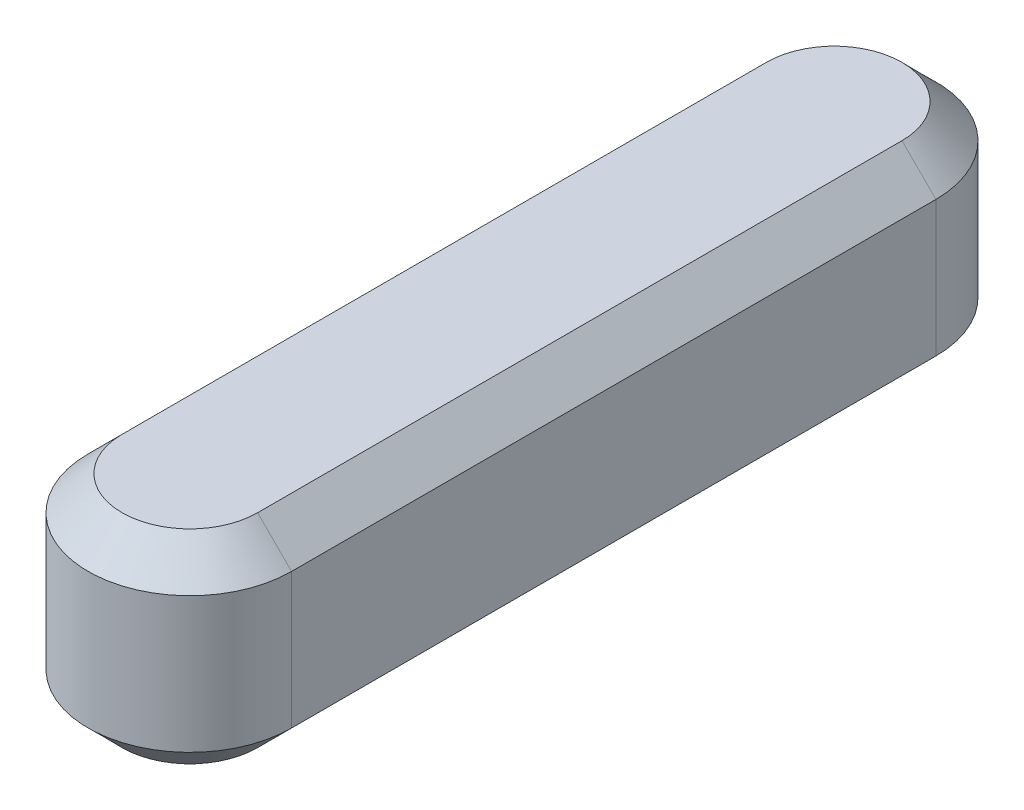
ISO-10303-21;
HEADER;
FILE_DESCRIPTION(('STEP AP214'),'2;1');
FILE_NAME('part.step','',(''),(''),'','','');
FILE_SCHEMA(('AUTOMOTIVE_DESIGN { 1 0 10303 214 1 1 1 1 }'));
ENDSEC;
DATA;
#1=APPLICATION_CONTEXT('core data for automotive mechanical design processes');
#2=APPLICATION_PROTOCOL_DEFINITION('international standard','automotive_design',2000,#1);
#3=PRODUCT_CONTEXT('',#1,'mechanical');
#4=PRODUCT('Part','Part','',(#3));
#5=PRODUCT_RELATED_PRODUCT_CATEGORY('part','',(#4));
#6=PRODUCT_DEFINITION_FORMATION('','',#4);
#7=PRODUCT_DEFINITION_CONTEXT('part definition',#1,'design');
#8=PRODUCT_DEFINITION('design','',#6,#7);
#9=PRODUCT_DEFINITION_SHAPE('','',#8);
#10=(LENGTH_UNIT() NAMED_UNIT(*) SI_UNIT(.MILLI.,.METRE.));
#11=(NAMED_UNIT(*) PLANE_ANGLE_UNIT() SI_UNIT($,.RADIAN.));
#12=(NAMED_UNIT(*) SI_UNIT($,.STERADIAN.) SOLID_ANGLE_UNIT());
#13=UNCERTAINTY_MEASURE_WITH_UNIT(LENGTH_MEASURE(1.E-05),#10,'distance_accuracy_value','');
#14=(GEOMETRIC_REPRESENTATION_CONTEXT(3) GLOBAL_UNCERTAINTY_ASSIGNED_CONTEXT((#13)) GLOBAL_UNIT_ASSIGNED_CONTEXT((#10,
#11,#12)) REPRESENTATION_CONTEXT('',''));
#15=CARTESIAN_POINT('',(0.,0.,0.));
#16=DIRECTION('',(0.,0.,1.));
#17=DIRECTION('',(1.,0.,0.));
#18=AXIS2_PLACEMENT_3D('',#15,#16,#17);
#19=CARTESIAN_POINT('',(0.,6.,0.));
#20=DIRECTION('',(0.,-1.,0.));
#21=DIRECTION('',(0.,0.,-1.));
#22=AXIS2_PLACEMENT_3D('',#19,#20,#21);
#23=CYLINDRICAL_SURFACE('',#22,3.);
#24=DIRECTION('',(0.,-1.,0.));
#25=VECTOR('',#24,1.);
#26=CARTESIAN_POINT('',(3.,6.,0.));
#27=LINE('',#26,#25);
#28=CARTESIAN_POINT('',(3.,5.,0.));
#29=VERTEX_POINT('',#28);
#30=CARTESIAN_POINT('',(3.,1.,0.));
#31=VERTEX_POINT('',#30);
#32=EDGE_CURVE('E136',#29,#31,#27,.T.);
#33=ORIENTED_EDGE('',*,*,#32,.F.);
#34=CARTESIAN_POINT('',(0.,5.,0.));
#35=DIRECTION('',(0.,-1.,0.));
#36=DIRECTION('',(0.,0.,-1.));
#37=AXIS2_PLACEMENT_3D('',#34,#35,#36);
#38=CIRCLE('',#37,3.);
#39=CARTESIAN_POINT('',(-3.,5.,0.));
#40=VERTEX_POINT('',#39);
#41=EDGE_CURVE('E185',#29,#40,#38,.T.);
#42=ORIENTED_EDGE('',*,*,#41,.T.);
#43=DIRECTION('',(0.,-1.,0.));
#44=VECTOR('',#43,1.);
#45=CARTESIAN_POINT('',(-3.,6.,0.));
#46=LINE('',#45,#44);
#47=CARTESIAN_POINT('',(-3.,1.,0.));
#48=VERTEX_POINT('',#47);
#49=EDGE_CURVE('E145',#40,#48,#46,.T.);
#50=ORIENTED_EDGE('',*,*,#49,.T.);
#51=CARTESIAN_POINT('',(0.,1.,0.));
#52=DIRECTION('',(0.,-1.,0.));
#53=DIRECTION('',(0.,0.,-1.));
#54=AXIS2_PLACEMENT_3D('',#51,#52,#53);
#55=CIRCLE('',#54,3.);
#56=EDGE_CURVE('E188',#48,#31,#55,.F.);
#57=ORIENTED_EDGE('',*,*,#56,.T.);
#58=EDGE_LOOP('',(#33,#42,#50,#57));
#59=FACE_BOUND('',#58,.T.);
#60=ADVANCED_FACE('F44',(#59),#23,.T.);
#61=CARTESIAN_POINT('',(3.,6.,0.));
#62=DIRECTION('',(-1.,0.,0.));
#63=DIRECTION('',(0.,0.,1.));
#64=AXIS2_PLACEMENT_3D('',#61,#62,#63);
#65=PLANE('',#64);
#66=DIRECTION('',(0.,-1.,0.));
#67=VECTOR('',#66,1.);
#68=CARTESIAN_POINT('',(3.,6.,-19.));
#69=LINE('',#68,#67);
#70=CARTESIAN_POINT('',(3.,5.,-19.));
#71=VERTEX_POINT('',#70);
#72=CARTESIAN_POINT('',(3.,1.,-19.));
#73=VERTEX_POINT('',#72);
#74=EDGE_CURVE('E210',#71,#73,#69,.T.);
#75=ORIENTED_EDGE('',*,*,#74,.F.);
#76=DIRECTION('',(0.,0.,1.));
#77=VECTOR('',#76,1.);
#78=CARTESIAN_POINT('',(3.,5.,0.));
#79=LINE('',#78,#77);
#80=EDGE_CURVE('E196',#71,#29,#79,.T.);
#81=ORIENTED_EDGE('',*,*,#80,.T.);
#82=ORIENTED_EDGE('',*,*,#32,.T.);
#83=DIRECTION('',(0.,0.,-1.));
#84=VECTOR('',#83,1.);
#85=CARTESIAN_POINT('',(3.,1.,-19.));
#86=LINE('',#85,#84);
#87=EDGE_CURVE('E200',#31,#73,#86,.T.);
#88=ORIENTED_EDGE('',*,*,#87,.T.);
#89=EDGE_LOOP('',(#75,#81,#82,#88));
#90=FACE_BOUND('',#89,.T.);
#91=ADVANCED_FACE('F243',(#90),#65,.F.);
#92=CARTESIAN_POINT('',(0.,6.,-19.));
#93=DIRECTION('',(0.,-1.,0.));
#94=DIRECTION('',(0.,0.,-1.));
#95=AXIS2_PLACEMENT_3D('',#92,#93,#94);
#96=CYLINDRICAL_SURFACE('',#95,3.);
#97=DIRECTION('',(0.,-1.,0.));
#98=VECTOR('',#97,1.);
#99=CARTESIAN_POINT('',(-3.,6.,-19.));
#100=LINE('',#99,#98);
#101=CARTESIAN_POINT('',(-3.,5.,-19.));
#102=VERTEX_POINT('',#101);
#103=CARTESIAN_POINT('',(-3.,1.,-19.));
#104=VERTEX_POINT('',#103);
#105=EDGE_CURVE('E214',#102,#104,#100,.T.);
#106=ORIENTED_EDGE('',*,*,#105,.F.);
#107=CARTESIAN_POINT('',(0.,5.,-19.));
#108=DIRECTION('',(0.,-1.,0.));
#109=DIRECTION('',(0.,0.,-1.));
#110=AXIS2_PLACEMENT_3D('',#107,#108,#109);
#111=CIRCLE('',#110,3.);
#112=EDGE_CURVE('E139',#102,#71,#111,.T.);
#113=ORIENTED_EDGE('',*,*,#112,.T.);
#114=ORIENTED_EDGE('',*,*,#74,.T.);
#115=CARTESIAN_POINT('',(0.,1.,-19.));
#116=DIRECTION('',(0.,-1.,0.));
#117=DIRECTION('',(0.,0.,-1.));
#118=AXIS2_PLACEMENT_3D('',#115,#116,#117);
#119=CIRCLE('',#118,3.);
#120=EDGE_CURVE('E193',#73,#104,#119,.F.);
#121=ORIENTED_EDGE('',*,*,#120,.T.);
#122=EDGE_LOOP('',(#106,#113,#114,#121));
#123=FACE_BOUND('',#122,.T.);
#124=ADVANCED_FACE('F247',(#123),#96,.T.);
#125=CARTESIAN_POINT('',(-3.,6.,0.));
#126=DIRECTION('',(1.,0.,0.));
#127=DIRECTION('',(0.,0.,-1.));
#128=AXIS2_PLACEMENT_3D('',#125,#126,#127);
#129=PLANE('',#128);
#130=ORIENTED_EDGE('',*,*,#49,.F.);
#131=DIRECTION('',(0.,0.,-1.));
#132=VECTOR('',#131,1.);
#133=CARTESIAN_POINT('',(-3.,5.,0.));
#134=LINE('',#133,#132);
#135=EDGE_CURVE('E178',#40,#102,#134,.T.);
#136=ORIENTED_EDGE('',*,*,#135,.T.);
#137=ORIENTED_EDGE('',*,*,#105,.T.);
#138=DIRECTION('',(0.,0.,1.));
#139=VECTOR('',#138,1.);
#140=CARTESIAN_POINT('',(-3.,1.,0.));
#141=LINE('',#140,#139);
#142=EDGE_CURVE('E181',#104,#48,#141,.T.);
#143=ORIENTED_EDGE('',*,*,#142,.T.);
#144=EDGE_LOOP('',(#130,#136,#137,#143));
#145=FACE_BOUND('',#144,.T.);
#146=ADVANCED_FACE('F225',(#145),#129,.F.);
#147=CARTESIAN_POINT('',(0.,6.,0.));
#148=DIRECTION('',(0.,-1.,0.));
#149=DIRECTION('',(0.,0.,-1.));
#150=AXIS2_PLACEMENT_3D('',#147,#148,#149);
#151=PLANE('',#150);
#152=CARTESIAN_POINT('',(0.,6.,0.));
#153=DIRECTION('',(0.,-1.,0.));
#154=DIRECTION('',(0.,0.,-1.));
#155=AXIS2_PLACEMENT_3D('',#152,#153,#154);
#156=CIRCLE('',#155,2.);
#157=CARTESIAN_POINT('',(-2.,6.,0.));
#158=VERTEX_POINT('',#157);
#159=CARTESIAN_POINT('',(2.,6.,0.));
#160=VERTEX_POINT('',#159);
#161=EDGE_CURVE('E124',#158,#160,#156,.F.);
#162=ORIENTED_EDGE('',*,*,#161,.T.);
#163=DIRECTION('',(0.,0.,-1.));
#164=VECTOR('',#163,1.);
#165=CARTESIAN_POINT('',(2.,6.,0.));
#166=LINE('',#165,#164);
#167=CARTESIAN_POINT('',(2.,6.,-19.));
#168=VERTEX_POINT('',#167);
#169=EDGE_CURVE('E119',#160,#168,#166,.T.);
#170=ORIENTED_EDGE('',*,*,#169,.T.);
#171=CARTESIAN_POINT('',(0.,6.,-19.));
#172=DIRECTION('',(0.,-1.,0.));
#173=DIRECTION('',(0.,0.,-1.));
#174=AXIS2_PLACEMENT_3D('',#171,#172,#173);
#175=CIRCLE('',#174,2.);
#176=CARTESIAN_POINT('',(-2.,6.,-19.));
#177=VERTEX_POINT('',#176);
#178=EDGE_CURVE('E113',#168,#177,#175,.F.);
#179=ORIENTED_EDGE('',*,*,#178,.T.);
#180=DIRECTION('',(0.,0.,1.));
#181=VECTOR('',#180,1.);
#182=CARTESIAN_POINT('',(-2.,6.,0.));
#183=LINE('',#182,#181);
#184=EDGE_CURVE('E116',#177,#158,#183,.T.);
#185=ORIENTED_EDGE('',*,*,#184,.T.);
#186=EDGE_LOOP('',(#162,#170,#179,#185));
#187=FACE_BOUND('',#186,.T.);
#188=ADVANCED_FACE('F115',(#187),#151,.F.);
#189=CARTESIAN_POINT('',(0.,0.,0.));
#190=DIRECTION('',(0.,-1.,0.));
#191=DIRECTION('',(0.,0.,-1.));
#192=AXIS2_PLACEMENT_3D('',#189,#190,#191);
#193=PLANE('',#192);
#194=CARTESIAN_POINT('',(0.,0.,0.));
#195=DIRECTION('',(0.,-1.,0.));
#196=DIRECTION('',(0.,0.,-1.));
#197=AXIS2_PLACEMENT_3D('',#194,#195,#196);
#198=CIRCLE('',#197,2.);
#199=CARTESIAN_POINT('',(2.,0.,0.));
#200=VERTEX_POINT('',#199);
#201=CARTESIAN_POINT('',(-2.,0.,0.));
#202=VERTEX_POINT('',#201);
#203=EDGE_CURVE('E55',#200,#202,#198,.T.);
#204=ORIENTED_EDGE('',*,*,#203,.T.);
#205=DIRECTION('',(0.,0.,-1.));
#206=VECTOR('',#205,1.);
#207=CARTESIAN_POINT('',(-2.,0.,-19.));
#208=LINE('',#207,#206);
#209=CARTESIAN_POINT('',(-2.,0.,-19.));
#210=VERTEX_POINT('',#209);
#211=EDGE_CURVE('E11',#202,#210,#208,.T.);
#212=ORIENTED_EDGE('',*,*,#211,.T.);
#213=CARTESIAN_POINT('',(0.,0.,-19.));
#214=DIRECTION('',(0.,-1.,0.));
#215=DIRECTION('',(0.,0.,-1.));
#216=AXIS2_PLACEMENT_3D('',#213,#214,#215);
#217=CIRCLE('',#216,2.);
#218=CARTESIAN_POINT('',(2.,0.,-19.));
#219=VERTEX_POINT('',#218);
#220=EDGE_CURVE('E172',#210,#219,#217,.T.);
#221=ORIENTED_EDGE('',*,*,#220,.T.);
#222=DIRECTION('',(0.,0.,1.));
#223=VECTOR('',#222,1.);
#224=CARTESIAN_POINT('',(2.,0.,0.));
#225=LINE('',#224,#223);
#226=EDGE_CURVE('E175',#219,#200,#225,.T.);
#227=ORIENTED_EDGE('',*,*,#226,.T.);
#228=EDGE_LOOP('',(#204,#212,#221,#227));
#229=FACE_BOUND('',#228,.T.);
#230=ADVANCED_FACE('F256',(#229),#193,.T.);
#231=CARTESIAN_POINT('',(-2.,6.,0.));
#232=DIRECTION('',(0.707106781186549,-0.707106781186546,0.));
#233=DIRECTION('',(0.,0.,1.));
#234=AXIS2_PLACEMENT_3D('',#231,#232,#233);
#235=PLANE('',#234);
#236=DIRECTION('',(0.707106781186546,0.707106781186549,0.));
#237=VECTOR('',#236,1.);
#238=CARTESIAN_POINT('',(-3.,5.,-19.));
#239=LINE('',#238,#237);
#240=EDGE_CURVE('E130',#102,#177,#239,.T.);
#241=ORIENTED_EDGE('',*,*,#240,.F.);
#242=ORIENTED_EDGE('',*,*,#135,.F.);
#243=DIRECTION('',(-0.707106781186546,-0.707106781186549,0.));
#244=VECTOR('',#243,1.);
#245=CARTESIAN_POINT('',(-2.,6.,0.));
#246=LINE('',#245,#244);
#247=EDGE_CURVE('E133',#158,#40,#246,.T.);
#248=ORIENTED_EDGE('',*,*,#247,.F.);
#249=ORIENTED_EDGE('',*,*,#184,.F.);
#250=EDGE_LOOP('',(#241,#242,#248,#249));
#251=FACE_BOUND('',#250,.T.);
#252=ADVANCED_FACE('F128',(#251),#235,.F.);
#253=CARTESIAN_POINT('',(0.,6.,0.));
#254=DIRECTION('',(0.,-1.,0.));
#255=DIRECTION('',(0.,0.,-1.));
#256=AXIS2_PLACEMENT_3D('',#253,#254,#255);
#257=CONICAL_SURFACE('',#256,2.,0.785398163397447);
#258=ORIENTED_EDGE('',*,*,#247,.T.);
#259=ORIENTED_EDGE('',*,*,#41,.F.);
#260=DIRECTION('',(0.707106781186546,-0.707106781186549,0.));
#261=VECTOR('',#260,1.);
#262=CARTESIAN_POINT('',(2.,6.,0.));
#263=LINE('',#262,#261);
#264=EDGE_CURVE('E141',#160,#29,#263,.T.);
#265=ORIENTED_EDGE('',*,*,#264,.F.);
#266=ORIENTED_EDGE('',*,*,#161,.F.);
#267=EDGE_LOOP('',(#258,#259,#265,#266));
#268=FACE_BOUND('',#267,.T.);
#269=ADVANCED_FACE('F228',(#268),#257,.T.);
#270=CARTESIAN_POINT('',(0.,6.,-19.));
#271=DIRECTION('',(0.,-1.,0.));
#272=DIRECTION('',(0.,0.,-1.));
#273=AXIS2_PLACEMENT_3D('',#270,#271,#272);
#274=CONICAL_SURFACE('',#273,2.,0.785398163397447);
#275=ORIENTED_EDGE('',*,*,#240,.T.);
#276=ORIENTED_EDGE('',*,*,#178,.F.);
#277=DIRECTION('',(-0.707106781186546,0.707106781186549,0.));
#278=VECTOR('',#277,1.);
#279=CARTESIAN_POINT('',(3.,5.,-19.));
#280=LINE('',#279,#278);
#281=EDGE_CURVE('E147',#71,#168,#280,.T.);
#282=ORIENTED_EDGE('',*,*,#281,.F.);
#283=ORIENTED_EDGE('',*,*,#112,.F.);
#284=EDGE_LOOP('',(#275,#276,#282,#283));
#285=FACE_BOUND('',#284,.T.);
#286=ADVANCED_FACE('F138',(#285),#274,.T.);
#287=CARTESIAN_POINT('',(2.,6.,0.));
#288=DIRECTION('',(-0.707106781186549,-0.707106781186546,0.));
#289=DIRECTION('',(0.,0.,-1.));
#290=AXIS2_PLACEMENT_3D('',#287,#288,#289);
#291=PLANE('',#290);
#292=ORIENTED_EDGE('',*,*,#264,.T.);
#293=ORIENTED_EDGE('',*,*,#80,.F.);
#294=ORIENTED_EDGE('',*,*,#281,.T.);
#295=ORIENTED_EDGE('',*,*,#169,.F.);
#296=EDGE_LOOP('',(#292,#293,#294,#295));
#297=FACE_BOUND('',#296,.T.);
#298=ADVANCED_FACE('F230',(#297),#291,.F.);
#299=CARTESIAN_POINT('',(3.,1.,0.));
#300=DIRECTION('',(0.707106781186547,-0.707106781186547,0.));
#301=DIRECTION('',(0.,0.,1.));
#302=AXIS2_PLACEMENT_3D('',#299,#300,#301);
#303=PLANE('',#302);
#304=DIRECTION('',(0.707106781186547,0.707106781186547,0.));
#305=VECTOR('',#304,1.);
#306=CARTESIAN_POINT('',(2.,0.,0.));
#307=LINE('',#306,#305);
#308=EDGE_CURVE('E155',#200,#31,#307,.T.);
#309=ORIENTED_EDGE('',*,*,#308,.F.);
#310=ORIENTED_EDGE('',*,*,#226,.F.);
#311=DIRECTION('',(-0.707106781186547,-0.707106781186547,0.));
#312=VECTOR('',#311,1.);
#313=CARTESIAN_POINT('',(3.,1.,-19.));
#314=LINE('',#313,#312);
#315=EDGE_CURVE('E49',#73,#219,#314,.T.);
#316=ORIENTED_EDGE('',*,*,#315,.F.);
#317=ORIENTED_EDGE('',*,*,#87,.F.);
#318=EDGE_LOOP('',(#309,#310,#316,#317));
#319=FACE_BOUND('',#318,.T.);
#320=ADVANCED_FACE('F47',(#319),#303,.T.);
#321=CARTESIAN_POINT('',(0.,1.,-19.));
#322=DIRECTION('',(0.,1.,0.));
#323=DIRECTION('',(0.,0.,1.));
#324=AXIS2_PLACEMENT_3D('',#321,#322,#323);
#325=CONICAL_SURFACE('',#324,3.,0.785398163397448);
#326=ORIENTED_EDGE('',*,*,#315,.T.);
#327=ORIENTED_EDGE('',*,*,#220,.F.);
#328=DIRECTION('',(0.707106781186547,-0.707106781186547,0.));
#329=VECTOR('',#328,1.);
#330=CARTESIAN_POINT('',(-3.,1.,-19.));
#331=LINE('',#330,#329);
#332=EDGE_CURVE('E68',#104,#210,#331,.T.);
#333=ORIENTED_EDGE('',*,*,#332,.F.);
#334=ORIENTED_EDGE('',*,*,#120,.F.);
#335=EDGE_LOOP('',(#326,#327,#333,#334));
#336=FACE_BOUND('',#335,.T.);
#337=ADVANCED_FACE('F237',(#336),#325,.T.);
#338=CARTESIAN_POINT('',(0.,1.,0.));
#339=DIRECTION('',(0.,1.,0.));
#340=DIRECTION('',(0.,0.,1.));
#341=AXIS2_PLACEMENT_3D('',#338,#339,#340);
#342=CONICAL_SURFACE('',#341,3.,0.785398163397448);
#343=ORIENTED_EDGE('',*,*,#308,.T.);
#344=ORIENTED_EDGE('',*,*,#56,.F.);
#345=DIRECTION('',(-0.707106781186547,0.707106781186547,0.));
#346=VECTOR('',#345,1.);
#347=CARTESIAN_POINT('',(-2.,0.,0.));
#348=LINE('',#347,#346);
#349=EDGE_CURVE('E151',#202,#48,#348,.T.);
#350=ORIENTED_EDGE('',*,*,#349,.F.);
#351=ORIENTED_EDGE('',*,*,#203,.F.);
#352=EDGE_LOOP('',(#343,#344,#350,#351));
#353=FACE_BOUND('',#352,.T.);
#354=ADVANCED_FACE('F306',(#353),#342,.T.);
#355=CARTESIAN_POINT('',(-3.,1.,0.));
#356=DIRECTION('',(-0.707106781186547,-0.707106781186547,0.));
#357=DIRECTION('',(0.,0.,-1.));
#358=AXIS2_PLACEMENT_3D('',#355,#356,#357);
#359=PLANE('',#358);
#360=ORIENTED_EDGE('',*,*,#332,.T.);
#361=ORIENTED_EDGE('',*,*,#211,.F.);
#362=ORIENTED_EDGE('',*,*,#349,.T.);
#363=ORIENTED_EDGE('',*,*,#142,.F.);
#364=EDGE_LOOP('',(#360,#361,#362,#363));
#365=FACE_BOUND('',#364,.T.);
#366=ADVANCED_FACE('F315',(#365),#359,.T.);
#367=CLOSED_SHELL('',(#60,#91,#124,#146,#188,#230,#252,#269,#286,#298,#320,#337,#354,#366));
#368=MANIFOLD_SOLID_BREP('B2',#367);
#369=ADVANCED_BREP_SHAPE_REPRESENTATION('',(#18,#368),#14);
#370=SHAPE_DEFINITION_REPRESENTATION(#9,#369);
ENDSEC;
END-ISO-10303-21;
